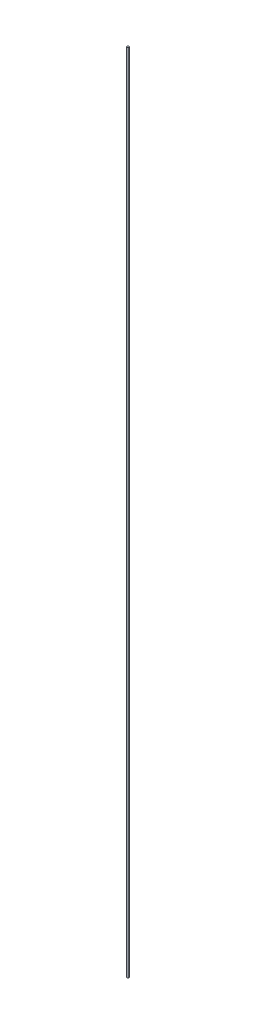
ISO-10303-21;
HEADER;
FILE_DESCRIPTION(('STEP AP214'),'2;1');
FILE_NAME('part.step','',(''),(''),'','','');
FILE_SCHEMA(('AUTOMOTIVE_DESIGN { 1 0 10303 214 1 1 1 1 }'));
ENDSEC;
DATA;
#1=APPLICATION_CONTEXT('core data for automotive mechanical design processes');
#2=APPLICATION_PROTOCOL_DEFINITION('international standard','automotive_design',2000,#1);
#3=PRODUCT_CONTEXT('',#1,'mechanical');
#4=PRODUCT('Part','Part','',(#3));
#5=PRODUCT_RELATED_PRODUCT_CATEGORY('part','',(#4));
#6=PRODUCT_DEFINITION_FORMATION('','',#4);
#7=PRODUCT_DEFINITION_CONTEXT('part definition',#1,'design');
#8=PRODUCT_DEFINITION('design','',#6,#7);
#9=PRODUCT_DEFINITION_SHAPE('','',#8);
#10=(LENGTH_UNIT() NAMED_UNIT(*) SI_UNIT(.MILLI.,.METRE.));
#11=(NAMED_UNIT(*) PLANE_ANGLE_UNIT() SI_UNIT($,.RADIAN.));
#12=(NAMED_UNIT(*) SI_UNIT($,.STERADIAN.) SOLID_ANGLE_UNIT());
#13=UNCERTAINTY_MEASURE_WITH_UNIT(LENGTH_MEASURE(1.E-05),#10,'distance_accuracy_value','');
#14=(GEOMETRIC_REPRESENTATION_CONTEXT(3) GLOBAL_UNCERTAINTY_ASSIGNED_CONTEXT((#13)) GLOBAL_UNIT_ASSIGNED_CONTEXT((#10,
#11,#12)) REPRESENTATION_CONTEXT('',''));
#15=CARTESIAN_POINT('',(0.,0.,0.));
#16=DIRECTION('',(0.,0.,1.));
#17=DIRECTION('',(1.,0.,0.));
#18=AXIS2_PLACEMENT_3D('',#15,#16,#17);
#19=CARTESIAN_POINT('',(0.,914.4,0.));
#20=DIRECTION('',(0.,-1.,0.));
#21=DIRECTION('',(0.,0.,-1.));
#22=AXIS2_PLACEMENT_3D('',#19,#20,#21);
#23=CYLINDRICAL_SURFACE('',#22,1.016);
#24=CARTESIAN_POINT('',(0.,914.4,0.));
#25=DIRECTION('',(0.,1.,0.));
#26=DIRECTION('',(0.,0.,1.));
#27=AXIS2_PLACEMENT_3D('',#24,#25,#26);
#28=CIRCLE('',#27,1.016);
#29=CARTESIAN_POINT('',(0.,914.4,1.016));
#30=VERTEX_POINT('',#29);
#31=EDGE_CURVE('E10',#30,#30,#28,.T.);
#32=ORIENTED_EDGE('',*,*,#31,.F.);
#33=EDGE_LOOP('',(#32));
#34=FACE_BOUND('',#33,.T.);
#35=CARTESIAN_POINT('',(0.,0.,0.));
#36=DIRECTION('',(0.,1.,0.));
#37=DIRECTION('',(0.,0.,1.));
#38=AXIS2_PLACEMENT_3D('',#35,#36,#37);
#39=CIRCLE('',#38,1.016);
#40=CARTESIAN_POINT('',(0.,0.,1.016));
#41=VERTEX_POINT('',#40);
#42=EDGE_CURVE('E34',#41,#41,#39,.T.);
#43=ORIENTED_EDGE('',*,*,#42,.T.);
#44=EDGE_LOOP('',(#43));
#45=FACE_BOUND('',#44,.T.);
#46=ADVANCED_FACE('F31',(#34,#45),#23,.T.);
#47=CARTESIAN_POINT('',(0.,914.4,0.));
#48=DIRECTION('',(0.,1.,0.));
#49=DIRECTION('',(0.,0.,1.));
#50=AXIS2_PLACEMENT_3D('',#47,#48,#49);
#51=PLANE('',#50);
#52=ORIENTED_EDGE('',*,*,#31,.T.);
#53=EDGE_LOOP('',(#52));
#54=FACE_BOUND('',#53,.T.);
#55=ADVANCED_FACE('F46',(#54),#51,.T.);
#56=CARTESIAN_POINT('',(0.,0.,0.));
#57=DIRECTION('',(0.,1.,0.));
#58=DIRECTION('',(0.,0.,1.));
#59=AXIS2_PLACEMENT_3D('',#56,#57,#58);
#60=PLANE('',#59);
#61=ORIENTED_EDGE('',*,*,#42,.F.);
#62=EDGE_LOOP('',(#61));
#63=FACE_BOUND('',#62,.T.);
#64=ADVANCED_FACE('F44',(#63),#60,.F.);
#65=CLOSED_SHELL('',(#46,#55,#64));
#66=MANIFOLD_SOLID_BREP('B2',#65);
#67=ADVANCED_BREP_SHAPE_REPRESENTATION('',(#18,#66),#14);
#68=SHAPE_DEFINITION_REPRESENTATION(#9,#67);
ENDSEC;
END-ISO-10303-21;
